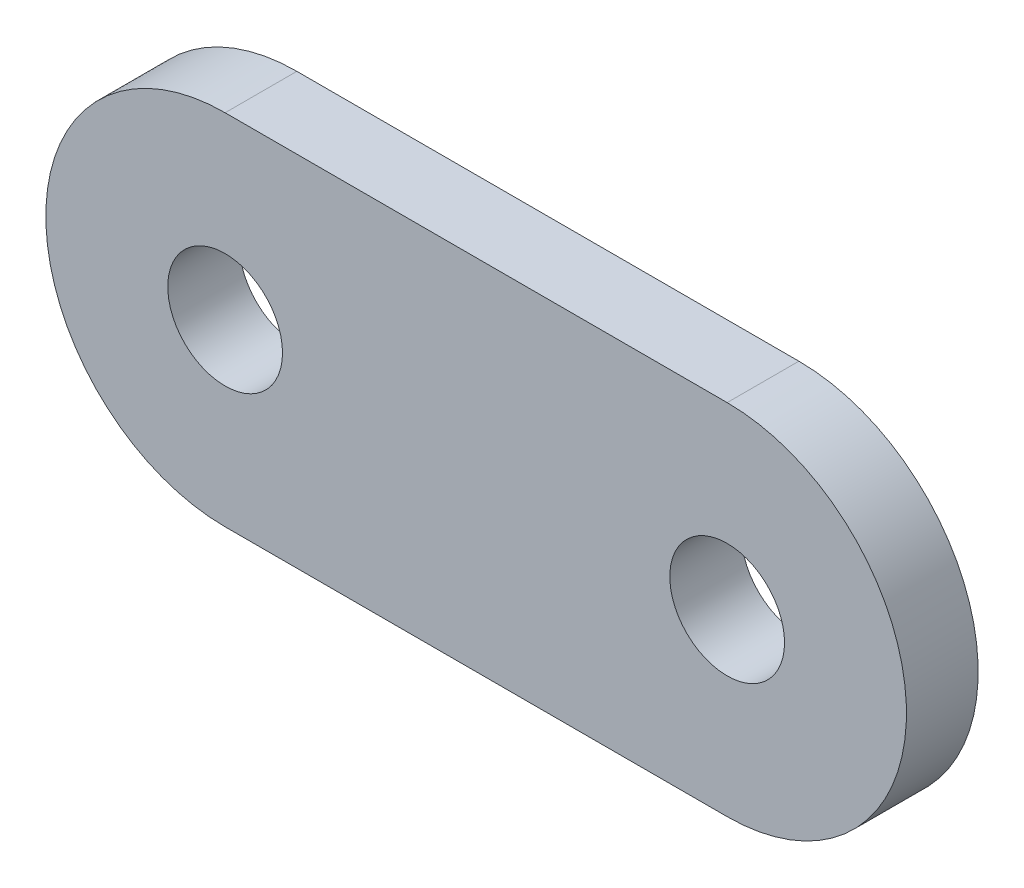
ISO-10303-21;
HEADER;
FILE_DESCRIPTION(('STEP AP214'),'2;1');
FILE_NAME('part.step','',(''),(''),'','','');
FILE_SCHEMA(('AUTOMOTIVE_DESIGN { 1 0 10303 214 1 1 1 1 }'));
ENDSEC;
DATA;
#1=APPLICATION_CONTEXT('core data for automotive mechanical design processes');
#2=APPLICATION_PROTOCOL_DEFINITION('international standard','automotive_design',2000,#1);
#3=PRODUCT_CONTEXT('',#1,'mechanical');
#4=PRODUCT('Part','Part','',(#3));
#5=PRODUCT_RELATED_PRODUCT_CATEGORY('part','',(#4));
#6=PRODUCT_DEFINITION_FORMATION('','',#4);
#7=PRODUCT_DEFINITION_CONTEXT('part definition',#1,'design');
#8=PRODUCT_DEFINITION('design','',#6,#7);
#9=PRODUCT_DEFINITION_SHAPE('','',#8);
#10=(LENGTH_UNIT() NAMED_UNIT(*) SI_UNIT(.MILLI.,.METRE.));
#11=(NAMED_UNIT(*) PLANE_ANGLE_UNIT() SI_UNIT($,.RADIAN.));
#12=(NAMED_UNIT(*) SI_UNIT($,.STERADIAN.) SOLID_ANGLE_UNIT());
#13=UNCERTAINTY_MEASURE_WITH_UNIT(LENGTH_MEASURE(1.E-05),#10,'distance_accuracy_value','');
#14=(GEOMETRIC_REPRESENTATION_CONTEXT(3) GLOBAL_UNCERTAINTY_ASSIGNED_CONTEXT((#13)) GLOBAL_UNIT_ASSIGNED_CONTEXT((#10,
#11,#12)) REPRESENTATION_CONTEXT('',''));
#15=CARTESIAN_POINT('',(0.,0.,0.));
#16=DIRECTION('',(0.,0.,1.));
#17=DIRECTION('',(1.,0.,0.));
#18=AXIS2_PLACEMENT_3D('',#15,#16,#17);
#19=CARTESIAN_POINT('',(-7.,0.,2.));
#20=DIRECTION('',(0.,0.,1.));
#21=DIRECTION('',(1.,0.,0.));
#22=AXIS2_PLACEMENT_3D('',#19,#20,#21);
#23=PLANE('',#22);
#24=CARTESIAN_POINT('',(7.,0.,2.));
#25=DIRECTION('',(0.,0.,1.));
#26=DIRECTION('',(1.,0.,0.));
#27=AXIS2_PLACEMENT_3D('',#24,#25,#26);
#28=CIRCLE('',#27,1.6);
#29=CARTESIAN_POINT('',(8.6,0.,2.));
#30=VERTEX_POINT('',#29);
#31=EDGE_CURVE('E100',#30,#30,#28,.T.);
#32=ORIENTED_EDGE('',*,*,#31,.F.);
#33=EDGE_LOOP('',(#32));
#34=FACE_BOUND('',#33,.T.);
#35=CARTESIAN_POINT('',(-7.,0.,2.));
#36=DIRECTION('',(0.,0.,1.));
#37=DIRECTION('',(1.,0.,0.));
#38=AXIS2_PLACEMENT_3D('',#35,#36,#37);
#39=CIRCLE('',#38,5.);
#40=CARTESIAN_POINT('',(-7.,5.,2.));
#41=VERTEX_POINT('',#40);
#42=CARTESIAN_POINT('',(-7.,-5.,2.));
#43=VERTEX_POINT('',#42);
#44=EDGE_CURVE('E85',#41,#43,#39,.T.);
#45=ORIENTED_EDGE('',*,*,#44,.T.);
#46=DIRECTION('',(1.,0.,0.));
#47=VECTOR('',#46,1.);
#48=CARTESIAN_POINT('',(-7.,-5.,2.));
#49=LINE('',#48,#47);
#50=CARTESIAN_POINT('',(7.,-5.,2.));
#51=VERTEX_POINT('',#50);
#52=EDGE_CURVE('E80',#43,#51,#49,.T.);
#53=ORIENTED_EDGE('',*,*,#52,.T.);
#54=CARTESIAN_POINT('',(7.,0.,2.));
#55=DIRECTION('',(0.,0.,1.));
#56=DIRECTION('',(1.,0.,0.));
#57=AXIS2_PLACEMENT_3D('',#54,#55,#56);
#58=CIRCLE('',#57,5.);
#59=CARTESIAN_POINT('',(7.,5.,2.));
#60=VERTEX_POINT('',#59);
#61=EDGE_CURVE('E83',#51,#60,#58,.T.);
#62=ORIENTED_EDGE('',*,*,#61,.T.);
#63=DIRECTION('',(-1.,0.,0.));
#64=VECTOR('',#63,1.);
#65=CARTESIAN_POINT('',(-7.,5.,2.));
#66=LINE('',#65,#64);
#67=EDGE_CURVE('E50',#60,#41,#66,.T.);
#68=ORIENTED_EDGE('',*,*,#67,.T.);
#69=EDGE_LOOP('',(#45,#53,#62,#68));
#70=FACE_BOUND('',#69,.T.);
#71=CARTESIAN_POINT('',(-7.,0.,2.));
#72=DIRECTION('',(0.,0.,1.));
#73=DIRECTION('',(1.,0.,0.));
#74=AXIS2_PLACEMENT_3D('',#71,#72,#73);
#75=CIRCLE('',#74,1.6);
#76=CARTESIAN_POINT('',(-5.4,0.,2.));
#77=VERTEX_POINT('',#76);
#78=EDGE_CURVE('E115',#77,#77,#75,.T.);
#79=ORIENTED_EDGE('',*,*,#78,.F.);
#80=EDGE_LOOP('',(#79));
#81=FACE_BOUND('',#80,.T.);
#82=ADVANCED_FACE('F33',(#34,#70,#81),#23,.T.);
#83=CARTESIAN_POINT('',(-7.,0.,0.));
#84=DIRECTION('',(0.,0.,1.));
#85=DIRECTION('',(1.,0.,0.));
#86=AXIS2_PLACEMENT_3D('',#83,#84,#85);
#87=PLANE('',#86);
#88=CARTESIAN_POINT('',(-7.,0.,0.));
#89=DIRECTION('',(0.,0.,1.));
#90=DIRECTION('',(1.,0.,0.));
#91=AXIS2_PLACEMENT_3D('',#88,#89,#90);
#92=CIRCLE('',#91,5.);
#93=CARTESIAN_POINT('',(-7.,5.,0.));
#94=VERTEX_POINT('',#93);
#95=CARTESIAN_POINT('',(-7.,-5.,0.));
#96=VERTEX_POINT('',#95);
#97=EDGE_CURVE('E97',#94,#96,#92,.T.);
#98=ORIENTED_EDGE('',*,*,#97,.F.);
#99=DIRECTION('',(-1.,0.,0.));
#100=VECTOR('',#99,1.);
#101=CARTESIAN_POINT('',(-7.,5.,0.));
#102=LINE('',#101,#100);
#103=CARTESIAN_POINT('',(7.,5.,0.));
#104=VERTEX_POINT('',#103);
#105=EDGE_CURVE('E73',#104,#94,#102,.T.);
#106=ORIENTED_EDGE('',*,*,#105,.F.);
#107=CARTESIAN_POINT('',(7.,0.,0.));
#108=DIRECTION('',(0.,0.,1.));
#109=DIRECTION('',(1.,0.,0.));
#110=AXIS2_PLACEMENT_3D('',#107,#108,#109);
#111=CIRCLE('',#110,5.);
#112=CARTESIAN_POINT('',(7.,-5.,0.));
#113=VERTEX_POINT('',#112);
#114=EDGE_CURVE('E67',#113,#104,#111,.T.);
#115=ORIENTED_EDGE('',*,*,#114,.F.);
#116=DIRECTION('',(1.,0.,0.));
#117=VECTOR('',#116,1.);
#118=CARTESIAN_POINT('',(-7.,-5.,0.));
#119=LINE('',#118,#117);
#120=EDGE_CURVE('E89',#96,#113,#119,.T.);
#121=ORIENTED_EDGE('',*,*,#120,.F.);
#122=EDGE_LOOP('',(#98,#106,#115,#121));
#123=FACE_BOUND('',#122,.T.);
#124=CARTESIAN_POINT('',(7.,0.,0.));
#125=DIRECTION('',(0.,0.,1.));
#126=DIRECTION('',(1.,0.,0.));
#127=AXIS2_PLACEMENT_3D('',#124,#125,#126);
#128=CIRCLE('',#127,1.6);
#129=CARTESIAN_POINT('',(8.6,0.,0.));
#130=VERTEX_POINT('',#129);
#131=EDGE_CURVE('E112',#130,#130,#128,.T.);
#132=ORIENTED_EDGE('',*,*,#131,.T.);
#133=EDGE_LOOP('',(#132));
#134=FACE_BOUND('',#133,.T.);
#135=CARTESIAN_POINT('',(-7.,0.,0.));
#136=DIRECTION('',(0.,0.,1.));
#137=DIRECTION('',(1.,0.,0.));
#138=AXIS2_PLACEMENT_3D('',#135,#136,#137);
#139=CIRCLE('',#138,1.6);
#140=CARTESIAN_POINT('',(-5.4,0.,0.));
#141=VERTEX_POINT('',#140);
#142=EDGE_CURVE('E118',#141,#141,#139,.T.);
#143=ORIENTED_EDGE('',*,*,#142,.T.);
#144=EDGE_LOOP('',(#143));
#145=FACE_BOUND('',#144,.T.);
#146=ADVANCED_FACE('F108',(#123,#134,#145),#87,.F.);
#147=CARTESIAN_POINT('',(-7.,0.,2.));
#148=DIRECTION('',(0.,0.,-1.));
#149=DIRECTION('',(-1.,0.,0.));
#150=AXIS2_PLACEMENT_3D('',#147,#148,#149);
#151=CYLINDRICAL_SURFACE('',#150,5.);
#152=ORIENTED_EDGE('',*,*,#97,.T.);
#153=DIRECTION('',(0.,0.,-1.));
#154=VECTOR('',#153,1.);
#155=CARTESIAN_POINT('',(-7.,-5.,2.));
#156=LINE('',#155,#154);
#157=EDGE_CURVE('E11',#43,#96,#156,.T.);
#158=ORIENTED_EDGE('',*,*,#157,.F.);
#159=ORIENTED_EDGE('',*,*,#44,.F.);
#160=DIRECTION('',(0.,0.,-1.));
#161=VECTOR('',#160,1.);
#162=CARTESIAN_POINT('',(-7.,5.,2.));
#163=LINE('',#162,#161);
#164=EDGE_CURVE('E93',#41,#94,#163,.T.);
#165=ORIENTED_EDGE('',*,*,#164,.T.);
#166=EDGE_LOOP('',(#152,#158,#159,#165));
#167=FACE_BOUND('',#166,.T.);
#168=ADVANCED_FACE('F35',(#167),#151,.T.);
#169=CARTESIAN_POINT('',(-7.,-5.,2.));
#170=DIRECTION('',(0.,1.,0.));
#171=DIRECTION('',(-1.,0.,0.));
#172=AXIS2_PLACEMENT_3D('',#169,#170,#171);
#173=PLANE('',#172);
#174=ORIENTED_EDGE('',*,*,#120,.T.);
#175=DIRECTION('',(0.,0.,-1.));
#176=VECTOR('',#175,1.);
#177=CARTESIAN_POINT('',(7.,-5.,2.));
#178=LINE('',#177,#176);
#179=EDGE_CURVE('E42',#51,#113,#178,.T.);
#180=ORIENTED_EDGE('',*,*,#179,.F.);
#181=ORIENTED_EDGE('',*,*,#52,.F.);
#182=ORIENTED_EDGE('',*,*,#157,.T.);
#183=EDGE_LOOP('',(#174,#180,#181,#182));
#184=FACE_BOUND('',#183,.T.);
#185=ADVANCED_FACE('F88',(#184),#173,.F.);
#186=CARTESIAN_POINT('',(7.,0.,2.));
#187=DIRECTION('',(0.,0.,-1.));
#188=DIRECTION('',(-1.,0.,0.));
#189=AXIS2_PLACEMENT_3D('',#186,#187,#188);
#190=CYLINDRICAL_SURFACE('',#189,5.);
#191=ORIENTED_EDGE('',*,*,#114,.T.);
#192=DIRECTION('',(0.,0.,-1.));
#193=VECTOR('',#192,1.);
#194=CARTESIAN_POINT('',(7.,5.,2.));
#195=LINE('',#194,#193);
#196=EDGE_CURVE('E90',#60,#104,#195,.T.);
#197=ORIENTED_EDGE('',*,*,#196,.F.);
#198=ORIENTED_EDGE('',*,*,#61,.F.);
#199=ORIENTED_EDGE('',*,*,#179,.T.);
#200=EDGE_LOOP('',(#191,#197,#198,#199));
#201=FACE_BOUND('',#200,.T.);
#202=ADVANCED_FACE('F91',(#201),#190,.T.);
#203=CARTESIAN_POINT('',(-7.,5.,2.));
#204=DIRECTION('',(0.,-1.,0.));
#205=DIRECTION('',(1.,0.,0.));
#206=AXIS2_PLACEMENT_3D('',#203,#204,#205);
#207=PLANE('',#206);
#208=ORIENTED_EDGE('',*,*,#105,.T.);
#209=ORIENTED_EDGE('',*,*,#164,.F.);
#210=ORIENTED_EDGE('',*,*,#67,.F.);
#211=ORIENTED_EDGE('',*,*,#196,.T.);
#212=EDGE_LOOP('',(#208,#209,#210,#211));
#213=FACE_BOUND('',#212,.T.);
#214=ADVANCED_FACE('F105',(#213),#207,.F.);
#215=CARTESIAN_POINT('',(7.,0.,2.));
#216=DIRECTION('',(0.,0.,-1.));
#217=DIRECTION('',(-1.,0.,0.));
#218=AXIS2_PLACEMENT_3D('',#215,#216,#217);
#219=CYLINDRICAL_SURFACE('',#218,1.6);
#220=ORIENTED_EDGE('',*,*,#31,.T.);
#221=EDGE_LOOP('',(#220));
#222=FACE_BOUND('',#221,.T.);
#223=ORIENTED_EDGE('',*,*,#131,.F.);
#224=EDGE_LOOP('',(#223));
#225=FACE_BOUND('',#224,.T.);
#226=ADVANCED_FACE('F135',(#222,#225),#219,.F.);
#227=CARTESIAN_POINT('',(-7.,0.,2.));
#228=DIRECTION('',(0.,0.,-1.));
#229=DIRECTION('',(-1.,0.,0.));
#230=AXIS2_PLACEMENT_3D('',#227,#228,#229);
#231=CYLINDRICAL_SURFACE('',#230,1.6);
#232=ORIENTED_EDGE('',*,*,#78,.T.);
#233=EDGE_LOOP('',(#232));
#234=FACE_BOUND('',#233,.T.);
#235=ORIENTED_EDGE('',*,*,#142,.F.);
#236=EDGE_LOOP('',(#235));
#237=FACE_BOUND('',#236,.T.);
#238=ADVANCED_FACE('F124',(#234,#237),#231,.F.);
#239=CLOSED_SHELL('',(#82,#146,#168,#185,#202,#214,#226,#238));
#240=MANIFOLD_SOLID_BREP('B2',#239);
#241=ADVANCED_BREP_SHAPE_REPRESENTATION('',(#18,#240),#14);
#242=SHAPE_DEFINITION_REPRESENTATION(#9,#241);
ENDSEC;
END-ISO-10303-21;
